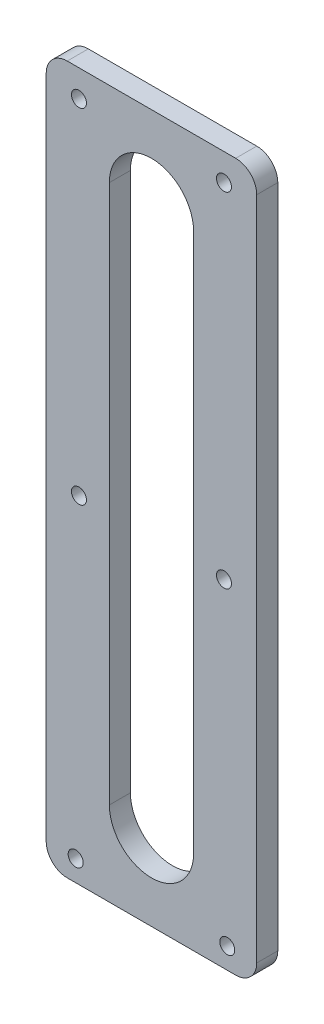
ISO-10303-21;
HEADER;
FILE_DESCRIPTION(('STEP AP214'),'2;1');
FILE_NAME('part.step','',(''),(''),'','','');
FILE_SCHEMA(('AUTOMOTIVE_DESIGN { 1 0 10303 214 1 1 1 1 }'));
ENDSEC;
DATA;
#1=APPLICATION_CONTEXT('core data for automotive mechanical design processes');
#2=APPLICATION_PROTOCOL_DEFINITION('international standard','automotive_design',2000,#1);
#3=PRODUCT_CONTEXT('',#1,'mechanical');
#4=PRODUCT('Part','Part','',(#3));
#5=PRODUCT_RELATED_PRODUCT_CATEGORY('part','',(#4));
#6=PRODUCT_DEFINITION_FORMATION('','',#4);
#7=PRODUCT_DEFINITION_CONTEXT('part definition',#1,'design');
#8=PRODUCT_DEFINITION('design','',#6,#7);
#9=PRODUCT_DEFINITION_SHAPE('','',#8);
#10=(LENGTH_UNIT() NAMED_UNIT(*) SI_UNIT(.MILLI.,.METRE.));
#11=(NAMED_UNIT(*) PLANE_ANGLE_UNIT() SI_UNIT($,.RADIAN.));
#12=(NAMED_UNIT(*) SI_UNIT($,.STERADIAN.) SOLID_ANGLE_UNIT());
#13=UNCERTAINTY_MEASURE_WITH_UNIT(LENGTH_MEASURE(1.E-05),#10,'distance_accuracy_value','');
#14=(GEOMETRIC_REPRESENTATION_CONTEXT(3) GLOBAL_UNCERTAINTY_ASSIGNED_CONTEXT((#13)) GLOBAL_UNIT_ASSIGNED_CONTEXT((#10,
#11,#12)) REPRESENTATION_CONTEXT('',''));
#15=CARTESIAN_POINT('',(0.,0.,0.));
#16=DIRECTION('',(0.,0.,1.));
#17=DIRECTION('',(1.,0.,0.));
#18=AXIS2_PLACEMENT_3D('',#15,#16,#17);
#19=CARTESIAN_POINT('',(0.,0.,0.));
#20=DIRECTION('',(0.,-1.,0.));
#21=DIRECTION('',(0.,0.,-1.));
#22=AXIS2_PLACEMENT_3D('',#19,#20,#21);
#23=PLANE('',#22);
#24=DIRECTION('',(1.,0.,0.));
#25=VECTOR('',#24,1.);
#26=CARTESIAN_POINT('',(0.,0.,0.));
#27=LINE('',#26,#25);
#28=CARTESIAN_POINT('',(3.175,0.,0.));
#29=VERTEX_POINT('',#28);
#30=CARTESIAN_POINT('',(28.575,0.,0.));
#31=VERTEX_POINT('',#30);
#32=EDGE_CURVE('E195',#29,#31,#27,.T.);
#33=ORIENTED_EDGE('',*,*,#32,.T.);
#34=DIRECTION('',(0.,0.,1.));
#35=VECTOR('',#34,1.);
#36=CARTESIAN_POINT('',(28.575,0.,0.));
#37=LINE('',#36,#35);
#38=CARTESIAN_POINT('',(28.575,0.,3.175));
#39=VERTEX_POINT('',#38);
#40=EDGE_CURVE('E228',#31,#39,#37,.T.);
#41=ORIENTED_EDGE('',*,*,#40,.T.);
#42=DIRECTION('',(1.,0.,0.));
#43=VECTOR('',#42,1.);
#44=CARTESIAN_POINT('',(0.,0.,3.175));
#45=LINE('',#44,#43);
#46=CARTESIAN_POINT('',(3.175,0.,3.175));
#47=VERTEX_POINT('',#46);
#48=EDGE_CURVE('E189',#47,#39,#45,.T.);
#49=ORIENTED_EDGE('',*,*,#48,.F.);
#50=DIRECTION('',(0.,0.,1.));
#51=VECTOR('',#50,1.);
#52=CARTESIAN_POINT('',(3.175,0.,0.));
#53=LINE('',#52,#51);
#54=EDGE_CURVE('E211',#47,#29,#53,.F.);
#55=ORIENTED_EDGE('',*,*,#54,.T.);
#56=EDGE_LOOP('',(#33,#41,#49,#55));
#57=FACE_BOUND('',#56,.T.);
#58=ADVANCED_FACE('F47',(#57),#23,.T.);
#59=CARTESIAN_POINT('',(0.,106.68,0.));
#60=DIRECTION('',(-1.,0.,0.));
#61=DIRECTION('',(0.,-1.,0.));
#62=AXIS2_PLACEMENT_3D('',#59,#60,#61);
#63=PLANE('',#62);
#64=DIRECTION('',(0.,-1.,0.));
#65=VECTOR('',#64,1.);
#66=CARTESIAN_POINT('',(0.,106.68,0.));
#67=LINE('',#66,#65);
#68=CARTESIAN_POINT('',(0.,103.505,0.));
#69=VERTEX_POINT('',#68);
#70=CARTESIAN_POINT('',(0.,3.17500000000003,0.));
#71=VERTEX_POINT('',#70);
#72=EDGE_CURVE('E207',#69,#71,#67,.T.);
#73=ORIENTED_EDGE('',*,*,#72,.T.);
#74=DIRECTION('',(0.,0.,1.));
#75=VECTOR('',#74,1.);
#76=CARTESIAN_POINT('',(0.,3.175,0.));
#77=LINE('',#76,#75);
#78=CARTESIAN_POINT('',(0.,3.17500000000003,3.175));
#79=VERTEX_POINT('',#78);
#80=EDGE_CURVE('E265',#71,#79,#77,.T.);
#81=ORIENTED_EDGE('',*,*,#80,.T.);
#82=DIRECTION('',(0.,-1.,0.));
#83=VECTOR('',#82,1.);
#84=CARTESIAN_POINT('',(0.,106.68,3.175));
#85=LINE('',#84,#83);
#86=CARTESIAN_POINT('',(0.,103.505,3.175));
#87=VERTEX_POINT('',#86);
#88=EDGE_CURVE('E200',#87,#79,#85,.T.);
#89=ORIENTED_EDGE('',*,*,#88,.F.);
#90=DIRECTION('',(0.,0.,1.));
#91=VECTOR('',#90,1.);
#92=CARTESIAN_POINT('',(0.,103.505,0.));
#93=LINE('',#92,#91);
#94=EDGE_CURVE('E262',#87,#69,#93,.F.);
#95=ORIENTED_EDGE('',*,*,#94,.T.);
#96=EDGE_LOOP('',(#73,#81,#89,#95));
#97=FACE_BOUND('',#96,.T.);
#98=ADVANCED_FACE('F298',(#97),#63,.T.);
#99=CARTESIAN_POINT('',(31.75,106.68,0.));
#100=DIRECTION('',(0.,1.,0.));
#101=DIRECTION('',(0.,0.,1.));
#102=AXIS2_PLACEMENT_3D('',#99,#100,#101);
#103=PLANE('',#102);
#104=DIRECTION('',(-1.,0.,0.));
#105=VECTOR('',#104,1.);
#106=CARTESIAN_POINT('',(31.75,106.68,3.175));
#107=LINE('',#106,#105);
#108=CARTESIAN_POINT('',(28.575,106.68,3.175));
#109=VERTEX_POINT('',#108);
#110=CARTESIAN_POINT('',(3.17499999999999,106.68,3.175));
#111=VERTEX_POINT('',#110);
#112=EDGE_CURVE('E219',#109,#111,#107,.T.);
#113=ORIENTED_EDGE('',*,*,#112,.F.);
#114=DIRECTION('',(0.,0.,1.));
#115=VECTOR('',#114,1.);
#116=CARTESIAN_POINT('',(28.575,106.68,0.));
#117=LINE('',#116,#115);
#118=CARTESIAN_POINT('',(28.575,106.68,0.));
#119=VERTEX_POINT('',#118);
#120=EDGE_CURVE('E11',#109,#119,#117,.F.);
#121=ORIENTED_EDGE('',*,*,#120,.T.);
#122=DIRECTION('',(-1.,0.,0.));
#123=VECTOR('',#122,1.);
#124=CARTESIAN_POINT('',(31.75,106.68,0.));
#125=LINE('',#124,#123);
#126=CARTESIAN_POINT('',(3.17499999999999,106.68,0.));
#127=VERTEX_POINT('',#126);
#128=EDGE_CURVE('E204',#119,#127,#125,.T.);
#129=ORIENTED_EDGE('',*,*,#128,.T.);
#130=DIRECTION('',(0.,0.,1.));
#131=VECTOR('',#130,1.);
#132=CARTESIAN_POINT('',(3.17499999999999,106.68,0.));
#133=LINE('',#132,#131);
#134=EDGE_CURVE('E56',#127,#111,#133,.T.);
#135=ORIENTED_EDGE('',*,*,#134,.T.);
#136=EDGE_LOOP('',(#113,#121,#129,#135));
#137=FACE_BOUND('',#136,.T.);
#138=ADVANCED_FACE('F271',(#137),#103,.T.);
#139=CARTESIAN_POINT('',(31.75,0.,0.));
#140=DIRECTION('',(1.,0.,0.));
#141=DIRECTION('',(0.,0.,-1.));
#142=AXIS2_PLACEMENT_3D('',#139,#140,#141);
#143=PLANE('',#142);
#144=DIRECTION('',(0.,1.,0.));
#145=VECTOR('',#144,1.);
#146=CARTESIAN_POINT('',(31.75,0.,3.175));
#147=LINE('',#146,#145);
#148=CARTESIAN_POINT('',(31.75,3.175,3.175));
#149=VERTEX_POINT('',#148);
#150=CARTESIAN_POINT('',(31.75,103.505,3.175));
#151=VERTEX_POINT('',#150);
#152=EDGE_CURVE('E215',#149,#151,#147,.T.);
#153=ORIENTED_EDGE('',*,*,#152,.F.);
#154=DIRECTION('',(0.,0.,1.));
#155=VECTOR('',#154,1.);
#156=CARTESIAN_POINT('',(31.75,3.175,0.));
#157=LINE('',#156,#155);
#158=CARTESIAN_POINT('',(31.75,3.175,0.));
#159=VERTEX_POINT('',#158);
#160=EDGE_CURVE('E248',#149,#159,#157,.F.);
#161=ORIENTED_EDGE('',*,*,#160,.T.);
#162=DIRECTION('',(0.,1.,0.));
#163=VECTOR('',#162,1.);
#164=CARTESIAN_POINT('',(31.75,0.,0.));
#165=LINE('',#164,#163);
#166=CARTESIAN_POINT('',(31.75,103.505,0.));
#167=VERTEX_POINT('',#166);
#168=EDGE_CURVE('E199',#159,#167,#165,.T.);
#169=ORIENTED_EDGE('',*,*,#168,.T.);
#170=DIRECTION('',(0.,0.,1.));
#171=VECTOR('',#170,1.);
#172=CARTESIAN_POINT('',(31.75,103.505,0.));
#173=LINE('',#172,#171);
#174=EDGE_CURVE('E244',#167,#151,#173,.T.);
#175=ORIENTED_EDGE('',*,*,#174,.T.);
#176=EDGE_LOOP('',(#153,#161,#169,#175));
#177=FACE_BOUND('',#176,.T.);
#178=ADVANCED_FACE('F282',(#177),#143,.T.);
#179=CARTESIAN_POINT('',(0.,0.,0.));
#180=DIRECTION('',(0.,0.,1.));
#181=DIRECTION('',(1.,0.,0.));
#182=AXIS2_PLACEMENT_3D('',#179,#180,#181);
#183=PLANE('',#182);
#184=CARTESIAN_POINT('',(4.44499999999999,3.175,0.));
#185=DIRECTION('',(0.,0.,-1.));
#186=DIRECTION('',(-1.,0.,0.));
#187=AXIS2_PLACEMENT_3D('',#184,#185,#186);
#188=CIRCLE('',#187,1.1303);
#189=CARTESIAN_POINT('',(3.31469999999999,3.175,0.));
#190=VERTEX_POINT('',#189);
#191=EDGE_CURVE('E561',#190,#190,#188,.T.);
#192=ORIENTED_EDGE('',*,*,#191,.F.);
#193=EDGE_LOOP('',(#192));
#194=FACE_BOUND('',#193,.T.);
#195=CARTESIAN_POINT('',(4.94030000000001,50.8,0.));
#196=DIRECTION('',(0.,0.,-1.));
#197=DIRECTION('',(-1.,0.,0.));
#198=AXIS2_PLACEMENT_3D('',#195,#196,#197);
#199=CIRCLE('',#198,1.1303);
#200=CARTESIAN_POINT('',(3.81000000000001,50.8,0.));
#201=VERTEX_POINT('',#200);
#202=EDGE_CURVE('E565',#201,#201,#199,.T.);
#203=ORIENTED_EDGE('',*,*,#202,.F.);
#204=EDGE_LOOP('',(#203));
#205=FACE_BOUND('',#204,.T.);
#206=CARTESIAN_POINT('',(27.305,3.175,0.));
#207=DIRECTION('',(0.,0.,-1.));
#208=DIRECTION('',(-1.,0.,0.));
#209=AXIS2_PLACEMENT_3D('',#206,#207,#208);
#210=CIRCLE('',#209,1.1303);
#211=CARTESIAN_POINT('',(26.1747,3.175,0.));
#212=VERTEX_POINT('',#211);
#213=EDGE_CURVE('E575',#212,#212,#210,.T.);
#214=ORIENTED_EDGE('',*,*,#213,.F.);
#215=EDGE_LOOP('',(#214));
#216=FACE_BOUND('',#215,.T.);
#217=CARTESIAN_POINT('',(26.8097,50.8,0.));
#218=DIRECTION('',(0.,0.,-1.));
#219=DIRECTION('',(-1.,0.,0.));
#220=AXIS2_PLACEMENT_3D('',#217,#218,#219);
#221=CIRCLE('',#220,1.1303);
#222=CARTESIAN_POINT('',(25.6794,50.8,0.));
#223=VERTEX_POINT('',#222);
#224=EDGE_CURVE('E583',#223,#223,#221,.T.);
#225=ORIENTED_EDGE('',*,*,#224,.F.);
#226=EDGE_LOOP('',(#225));
#227=FACE_BOUND('',#226,.T.);
#228=CARTESIAN_POINT('',(26.8097,102.616,0.));
#229=DIRECTION('',(0.,0.,-1.));
#230=DIRECTION('',(-1.,0.,0.));
#231=AXIS2_PLACEMENT_3D('',#228,#229,#230);
#232=CIRCLE('',#231,1.1303);
#233=CARTESIAN_POINT('',(25.6794,102.616,0.));
#234=VERTEX_POINT('',#233);
#235=EDGE_CURVE('E591',#234,#234,#232,.T.);
#236=ORIENTED_EDGE('',*,*,#235,.F.);
#237=EDGE_LOOP('',(#236));
#238=FACE_BOUND('',#237,.T.);
#239=CARTESIAN_POINT('',(4.94030000000001,102.616,0.));
#240=DIRECTION('',(0.,0.,-1.));
#241=DIRECTION('',(-1.,0.,0.));
#242=AXIS2_PLACEMENT_3D('',#239,#240,#241);
#243=CIRCLE('',#242,1.1303);
#244=CARTESIAN_POINT('',(3.81000000000001,102.616,0.));
#245=VERTEX_POINT('',#244);
#246=EDGE_CURVE('E598',#245,#245,#243,.T.);
#247=ORIENTED_EDGE('',*,*,#246,.F.);
#248=EDGE_LOOP('',(#247));
#249=FACE_BOUND('',#248,.T.);
#250=DIRECTION('',(0.,1.,0.));
#251=VECTOR('',#250,1.);
#252=CARTESIAN_POINT('',(22.225,93.98,0.));
#253=LINE('',#252,#251);
#254=CARTESIAN_POINT('',(22.225,12.7,0.));
#255=VERTEX_POINT('',#254);
#256=CARTESIAN_POINT('',(22.225,93.98,0.));
#257=VERTEX_POINT('',#256);
#258=EDGE_CURVE('E150',#255,#257,#253,.T.);
#259=ORIENTED_EDGE('',*,*,#258,.T.);
#260=CARTESIAN_POINT('',(15.875,93.98,0.));
#261=DIRECTION('',(0.,0.,1.));
#262=DIRECTION('',(-1.,0.,0.));
#263=AXIS2_PLACEMENT_3D('',#260,#261,#262);
#264=CIRCLE('',#263,6.34999999999999);
#265=CARTESIAN_POINT('',(9.52500000000002,93.98,0.));
#266=VERTEX_POINT('',#265);
#267=EDGE_CURVE('E141',#257,#266,#264,.T.);
#268=ORIENTED_EDGE('',*,*,#267,.T.);
#269=DIRECTION('',(0.,-1.,0.));
#270=VECTOR('',#269,1.);
#271=CARTESIAN_POINT('',(9.52500000000002,12.7,0.));
#272=LINE('',#271,#270);
#273=CARTESIAN_POINT('',(9.52500000000002,12.7,0.));
#274=VERTEX_POINT('',#273);
#275=EDGE_CURVE('E154',#266,#274,#272,.T.);
#276=ORIENTED_EDGE('',*,*,#275,.T.);
#277=CARTESIAN_POINT('',(15.875,12.7,0.));
#278=DIRECTION('',(0.,0.,1.));
#279=DIRECTION('',(-1.,0.,0.));
#280=AXIS2_PLACEMENT_3D('',#277,#278,#279);
#281=CIRCLE('',#280,6.35);
#282=EDGE_CURVE('E159',#274,#255,#281,.T.);
#283=ORIENTED_EDGE('',*,*,#282,.T.);
#284=EDGE_LOOP('',(#259,#268,#276,#283));
#285=FACE_BOUND('',#284,.T.);
#286=ORIENTED_EDGE('',*,*,#168,.F.);
#287=CARTESIAN_POINT('',(28.575,3.175,0.));
#288=DIRECTION('',(0.,0.,1.));
#289=DIRECTION('',(1.,0.,0.));
#290=AXIS2_PLACEMENT_3D('',#287,#288,#289);
#291=CIRCLE('',#290,3.175);
#292=EDGE_CURVE('E259',#159,#31,#291,.F.);
#293=ORIENTED_EDGE('',*,*,#292,.T.);
#294=ORIENTED_EDGE('',*,*,#32,.F.);
#295=CARTESIAN_POINT('',(3.175,3.175,0.));
#296=DIRECTION('',(0.,0.,1.));
#297=DIRECTION('',(1.,0.,0.));
#298=AXIS2_PLACEMENT_3D('',#295,#296,#297);
#299=CIRCLE('',#298,3.175);
#300=EDGE_CURVE('E256',#29,#71,#299,.F.);
#301=ORIENTED_EDGE('',*,*,#300,.T.);
#302=ORIENTED_EDGE('',*,*,#72,.F.);
#303=CARTESIAN_POINT('',(3.17499999999999,103.505,0.));
#304=DIRECTION('',(0.,0.,1.));
#305=DIRECTION('',(1.,0.,0.));
#306=AXIS2_PLACEMENT_3D('',#303,#304,#305);
#307=CIRCLE('',#306,3.175);
#308=EDGE_CURVE('E63',#69,#127,#307,.F.);
#309=ORIENTED_EDGE('',*,*,#308,.T.);
#310=ORIENTED_EDGE('',*,*,#128,.F.);
#311=CARTESIAN_POINT('',(28.575,103.505,0.));
#312=DIRECTION('',(0.,0.,1.));
#313=DIRECTION('',(1.,0.,0.));
#314=AXIS2_PLACEMENT_3D('',#311,#312,#313);
#315=CIRCLE('',#314,3.175);
#316=EDGE_CURVE('E253',#119,#167,#315,.F.);
#317=ORIENTED_EDGE('',*,*,#316,.T.);
#318=EDGE_LOOP('',(#286,#293,#294,#301,#302,#309,#310,#317));
#319=FACE_BOUND('',#318,.T.);
#320=ADVANCED_FACE('F161',(#194,#205,#216,#227,#238,#249,#285,#319),#183,.F.);
#321=CARTESIAN_POINT('',(0.,0.,3.175));
#322=DIRECTION('',(0.,0.,1.));
#323=DIRECTION('',(1.,0.,0.));
#324=AXIS2_PLACEMENT_3D('',#321,#322,#323);
#325=PLANE('',#324);
#326=CARTESIAN_POINT('',(4.44499999999999,3.175,3.175));
#327=DIRECTION('',(0.,0.,-1.));
#328=DIRECTION('',(-1.,0.,0.));
#329=AXIS2_PLACEMENT_3D('',#326,#327,#328);
#330=CIRCLE('',#329,1.1303);
#331=CARTESIAN_POINT('',(3.31469999999999,3.175,3.175));
#332=VERTEX_POINT('',#331);
#333=EDGE_CURVE('E558',#332,#332,#330,.T.);
#334=ORIENTED_EDGE('',*,*,#333,.T.);
#335=EDGE_LOOP('',(#334));
#336=FACE_BOUND('',#335,.T.);
#337=CARTESIAN_POINT('',(4.94030000000001,50.8,3.175));
#338=DIRECTION('',(0.,0.,-1.));
#339=DIRECTION('',(-1.,0.,0.));
#340=AXIS2_PLACEMENT_3D('',#337,#338,#339);
#341=CIRCLE('',#340,1.1303);
#342=CARTESIAN_POINT('',(3.81000000000001,50.8,3.175));
#343=VERTEX_POINT('',#342);
#344=EDGE_CURVE('E571',#343,#343,#341,.T.);
#345=ORIENTED_EDGE('',*,*,#344,.T.);
#346=EDGE_LOOP('',(#345));
#347=FACE_BOUND('',#346,.T.);
#348=CARTESIAN_POINT('',(27.305,3.175,3.175));
#349=DIRECTION('',(0.,0.,-1.));
#350=DIRECTION('',(-1.,0.,0.));
#351=AXIS2_PLACEMENT_3D('',#348,#349,#350);
#352=CIRCLE('',#351,1.1303);
#353=CARTESIAN_POINT('',(26.1747,3.175,3.175));
#354=VERTEX_POINT('',#353);
#355=EDGE_CURVE('E579',#354,#354,#352,.T.);
#356=ORIENTED_EDGE('',*,*,#355,.T.);
#357=EDGE_LOOP('',(#356));
#358=FACE_BOUND('',#357,.T.);
#359=CARTESIAN_POINT('',(26.8097,50.8,3.175));
#360=DIRECTION('',(0.,0.,-1.));
#361=DIRECTION('',(-1.,0.,0.));
#362=AXIS2_PLACEMENT_3D('',#359,#360,#361);
#363=CIRCLE('',#362,1.1303);
#364=CARTESIAN_POINT('',(25.6794,50.8,3.175));
#365=VERTEX_POINT('',#364);
#366=EDGE_CURVE('E587',#365,#365,#363,.T.);
#367=ORIENTED_EDGE('',*,*,#366,.T.);
#368=EDGE_LOOP('',(#367));
#369=FACE_BOUND('',#368,.T.);
#370=CARTESIAN_POINT('',(26.8097,102.616,3.175));
#371=DIRECTION('',(0.,0.,-1.));
#372=DIRECTION('',(-1.,0.,0.));
#373=AXIS2_PLACEMENT_3D('',#370,#371,#372);
#374=CIRCLE('',#373,1.1303);
#375=CARTESIAN_POINT('',(25.6794,102.616,3.175));
#376=VERTEX_POINT('',#375);
#377=EDGE_CURVE('E595',#376,#376,#374,.T.);
#378=ORIENTED_EDGE('',*,*,#377,.T.);
#379=EDGE_LOOP('',(#378));
#380=FACE_BOUND('',#379,.T.);
#381=CARTESIAN_POINT('',(4.94030000000001,102.616,3.175));
#382=DIRECTION('',(0.,0.,-1.));
#383=DIRECTION('',(-1.,0.,0.));
#384=AXIS2_PLACEMENT_3D('',#381,#382,#383);
#385=CIRCLE('',#384,1.1303);
#386=CARTESIAN_POINT('',(3.81000000000002,102.616,3.175));
#387=VERTEX_POINT('',#386);
#388=EDGE_CURVE('E171',#387,#387,#385,.T.);
#389=ORIENTED_EDGE('',*,*,#388,.T.);
#390=EDGE_LOOP('',(#389));
#391=FACE_BOUND('',#390,.T.);
#392=CARTESIAN_POINT('',(15.875,93.98,3.175));
#393=DIRECTION('',(0.,0.,1.));
#394=DIRECTION('',(-1.,0.,0.));
#395=AXIS2_PLACEMENT_3D('',#392,#393,#394);
#396=CIRCLE('',#395,6.34999999999999);
#397=CARTESIAN_POINT('',(22.225,93.98,3.175));
#398=VERTEX_POINT('',#397);
#399=CARTESIAN_POINT('',(9.52500000000002,93.98,3.175));
#400=VERTEX_POINT('',#399);
#401=EDGE_CURVE('E144',#398,#400,#396,.T.);
#402=ORIENTED_EDGE('',*,*,#401,.F.);
#403=DIRECTION('',(0.,1.,0.));
#404=VECTOR('',#403,1.);
#405=CARTESIAN_POINT('',(22.225,93.98,3.175));
#406=LINE('',#405,#404);
#407=CARTESIAN_POINT('',(22.225,12.7,3.175));
#408=VERTEX_POINT('',#407);
#409=EDGE_CURVE('E164',#408,#398,#406,.T.);
#410=ORIENTED_EDGE('',*,*,#409,.F.);
#411=CARTESIAN_POINT('',(15.875,12.7,3.175));
#412=DIRECTION('',(0.,0.,1.));
#413=DIRECTION('',(-1.,0.,0.));
#414=AXIS2_PLACEMENT_3D('',#411,#412,#413);
#415=CIRCLE('',#414,6.35);
#416=CARTESIAN_POINT('',(9.52500000000002,12.7,3.175));
#417=VERTEX_POINT('',#416);
#418=EDGE_CURVE('E168',#417,#408,#415,.T.);
#419=ORIENTED_EDGE('',*,*,#418,.F.);
#420=DIRECTION('',(0.,-1.,0.));
#421=VECTOR('',#420,1.);
#422=CARTESIAN_POINT('',(9.52500000000002,12.7,3.175));
#423=LINE('',#422,#421);
#424=EDGE_CURVE('E180',#400,#417,#423,.T.);
#425=ORIENTED_EDGE('',*,*,#424,.F.);
#426=EDGE_LOOP('',(#402,#410,#419,#425));
#427=FACE_BOUND('',#426,.T.);
#428=ORIENTED_EDGE('',*,*,#48,.T.);
#429=CARTESIAN_POINT('',(28.575,3.175,3.175));
#430=DIRECTION('',(0.,0.,1.));
#431=DIRECTION('',(1.,0.,0.));
#432=AXIS2_PLACEMENT_3D('',#429,#430,#431);
#433=CIRCLE('',#432,3.175);
#434=EDGE_CURVE('E241',#39,#149,#433,.T.);
#435=ORIENTED_EDGE('',*,*,#434,.T.);
#436=ORIENTED_EDGE('',*,*,#152,.T.);
#437=CARTESIAN_POINT('',(28.575,103.505,3.175));
#438=DIRECTION('',(0.,0.,1.));
#439=DIRECTION('',(1.,0.,0.));
#440=AXIS2_PLACEMENT_3D('',#437,#438,#439);
#441=CIRCLE('',#440,3.175);
#442=EDGE_CURVE('E235',#151,#109,#441,.T.);
#443=ORIENTED_EDGE('',*,*,#442,.T.);
#444=ORIENTED_EDGE('',*,*,#112,.T.);
#445=CARTESIAN_POINT('',(3.17499999999999,103.505,3.175));
#446=DIRECTION('',(0.,0.,1.));
#447=DIRECTION('',(1.,0.,0.));
#448=AXIS2_PLACEMENT_3D('',#445,#446,#447);
#449=CIRCLE('',#448,3.175);
#450=EDGE_CURVE('E232',#111,#87,#449,.T.);
#451=ORIENTED_EDGE('',*,*,#450,.T.);
#452=ORIENTED_EDGE('',*,*,#88,.T.);
#453=CARTESIAN_POINT('',(3.175,3.175,3.175));
#454=DIRECTION('',(0.,0.,1.));
#455=DIRECTION('',(1.,0.,0.));
#456=AXIS2_PLACEMENT_3D('',#453,#454,#455);
#457=CIRCLE('',#456,3.175);
#458=EDGE_CURVE('E238',#79,#47,#457,.T.);
#459=ORIENTED_EDGE('',*,*,#458,.T.);
#460=EDGE_LOOP('',(#428,#435,#436,#443,#444,#451,#452,#459));
#461=FACE_BOUND('',#460,.T.);
#462=ADVANCED_FACE('F274',(#336,#347,#358,#369,#380,#391,#427,#461),#325,.T.);
#463=CARTESIAN_POINT('',(15.875,93.98,0.));
#464=DIRECTION('',(0.,0.,1.));
#465=DIRECTION('',(1.,0.,0.));
#466=AXIS2_PLACEMENT_3D('',#463,#464,#465);
#467=CYLINDRICAL_SURFACE('',#466,6.34999999999999);
#468=ORIENTED_EDGE('',*,*,#401,.T.);
#469=DIRECTION('',(0.,0.,1.));
#470=VECTOR('',#469,1.);
#471=CARTESIAN_POINT('',(9.52500000000002,93.98,0.));
#472=LINE('',#471,#470);
#473=EDGE_CURVE('E137',#266,#400,#472,.T.);
#474=ORIENTED_EDGE('',*,*,#473,.F.);
#475=ORIENTED_EDGE('',*,*,#267,.F.);
#476=DIRECTION('',(0.,0.,1.));
#477=VECTOR('',#476,1.);
#478=CARTESIAN_POINT('',(22.225,93.98,0.));
#479=LINE('',#478,#477);
#480=EDGE_CURVE('E186',#257,#398,#479,.T.);
#481=ORIENTED_EDGE('',*,*,#480,.T.);
#482=EDGE_LOOP('',(#468,#474,#475,#481));
#483=FACE_BOUND('',#482,.T.);
#484=ADVANCED_FACE('F139',(#483),#467,.F.);
#485=CARTESIAN_POINT('',(22.225,93.98,0.));
#486=DIRECTION('',(1.,0.,0.));
#487=DIRECTION('',(0.,1.,0.));
#488=AXIS2_PLACEMENT_3D('',#485,#486,#487);
#489=PLANE('',#488);
#490=ORIENTED_EDGE('',*,*,#409,.T.);
#491=ORIENTED_EDGE('',*,*,#480,.F.);
#492=ORIENTED_EDGE('',*,*,#258,.F.);
#493=DIRECTION('',(0.,0.,1.));
#494=VECTOR('',#493,1.);
#495=CARTESIAN_POINT('',(22.225,12.7,0.));
#496=LINE('',#495,#494);
#497=EDGE_CURVE('E190',#255,#408,#496,.T.);
#498=ORIENTED_EDGE('',*,*,#497,.T.);
#499=EDGE_LOOP('',(#490,#491,#492,#498));
#500=FACE_BOUND('',#499,.T.);
#501=ADVANCED_FACE('F482',(#500),#489,.F.);
#502=CARTESIAN_POINT('',(15.875,12.7,0.));
#503=DIRECTION('',(0.,0.,1.));
#504=DIRECTION('',(1.,0.,0.));
#505=AXIS2_PLACEMENT_3D('',#502,#503,#504);
#506=CYLINDRICAL_SURFACE('',#505,6.35);
#507=ORIENTED_EDGE('',*,*,#418,.T.);
#508=ORIENTED_EDGE('',*,*,#497,.F.);
#509=ORIENTED_EDGE('',*,*,#282,.F.);
#510=DIRECTION('',(0.,0.,1.));
#511=VECTOR('',#510,1.);
#512=CARTESIAN_POINT('',(9.52500000000002,12.7,0.));
#513=LINE('',#512,#511);
#514=EDGE_CURVE('E149',#274,#417,#513,.T.);
#515=ORIENTED_EDGE('',*,*,#514,.T.);
#516=EDGE_LOOP('',(#507,#508,#509,#515));
#517=FACE_BOUND('',#516,.T.);
#518=ADVANCED_FACE('F471',(#517),#506,.F.);
#519=CARTESIAN_POINT('',(9.52500000000002,12.7,0.));
#520=DIRECTION('',(-1.,0.,0.));
#521=DIRECTION('',(0.,-1.,0.));
#522=AXIS2_PLACEMENT_3D('',#519,#520,#521);
#523=PLANE('',#522);
#524=ORIENTED_EDGE('',*,*,#424,.T.);
#525=ORIENTED_EDGE('',*,*,#514,.F.);
#526=ORIENTED_EDGE('',*,*,#275,.F.);
#527=ORIENTED_EDGE('',*,*,#473,.T.);
#528=EDGE_LOOP('',(#524,#525,#526,#527));
#529=FACE_BOUND('',#528,.T.);
#530=ADVANCED_FACE('F155',(#529),#523,.F.);
#531=CARTESIAN_POINT('',(28.575,3.175,0.));
#532=DIRECTION('',(0.,0.,1.));
#533=DIRECTION('',(1.,0.,0.));
#534=AXIS2_PLACEMENT_3D('',#531,#532,#533);
#535=CYLINDRICAL_SURFACE('',#534,3.175);
#536=ORIENTED_EDGE('',*,*,#292,.F.);
#537=ORIENTED_EDGE('',*,*,#160,.F.);
#538=ORIENTED_EDGE('',*,*,#434,.F.);
#539=ORIENTED_EDGE('',*,*,#40,.F.);
#540=EDGE_LOOP('',(#536,#537,#538,#539));
#541=FACE_BOUND('',#540,.T.);
#542=ADVANCED_FACE('F289',(#541),#535,.T.);
#543=CARTESIAN_POINT('',(3.175,3.175,0.));
#544=DIRECTION('',(0.,0.,1.));
#545=DIRECTION('',(1.,0.,0.));
#546=AXIS2_PLACEMENT_3D('',#543,#544,#545);
#547=CYLINDRICAL_SURFACE('',#546,3.175);
#548=ORIENTED_EDGE('',*,*,#300,.F.);
#549=ORIENTED_EDGE('',*,*,#54,.F.);
#550=ORIENTED_EDGE('',*,*,#458,.F.);
#551=ORIENTED_EDGE('',*,*,#80,.F.);
#552=EDGE_LOOP('',(#548,#549,#550,#551));
#553=FACE_BOUND('',#552,.T.);
#554=ADVANCED_FACE('F296',(#553),#547,.T.);
#555=CARTESIAN_POINT('',(28.575,103.505,0.));
#556=DIRECTION('',(0.,0.,1.));
#557=DIRECTION('',(1.,0.,0.));
#558=AXIS2_PLACEMENT_3D('',#555,#556,#557);
#559=CYLINDRICAL_SURFACE('',#558,3.175);
#560=ORIENTED_EDGE('',*,*,#316,.F.);
#561=ORIENTED_EDGE('',*,*,#120,.F.);
#562=ORIENTED_EDGE('',*,*,#442,.F.);
#563=ORIENTED_EDGE('',*,*,#174,.F.);
#564=EDGE_LOOP('',(#560,#561,#562,#563));
#565=FACE_BOUND('',#564,.T.);
#566=ADVANCED_FACE('F280',(#565),#559,.T.);
#567=CARTESIAN_POINT('',(3.17499999999999,103.505,0.));
#568=DIRECTION('',(0.,0.,1.));
#569=DIRECTION('',(1.,0.,0.));
#570=AXIS2_PLACEMENT_3D('',#567,#568,#569);
#571=CYLINDRICAL_SURFACE('',#570,3.175);
#572=ORIENTED_EDGE('',*,*,#308,.F.);
#573=ORIENTED_EDGE('',*,*,#94,.F.);
#574=ORIENTED_EDGE('',*,*,#450,.F.);
#575=ORIENTED_EDGE('',*,*,#134,.F.);
#576=EDGE_LOOP('',(#572,#573,#574,#575));
#577=FACE_BOUND('',#576,.T.);
#578=ADVANCED_FACE('F49',(#577),#571,.T.);
#579=CARTESIAN_POINT('',(4.94030000000001,102.616,0.));
#580=DIRECTION('',(0.,0.,-1.));
#581=DIRECTION('',(-1.,0.,0.));
#582=AXIS2_PLACEMENT_3D('',#579,#580,#581);
#583=CYLINDRICAL_SURFACE('',#582,1.1303);
#584=ORIENTED_EDGE('',*,*,#388,.F.);
#585=EDGE_LOOP('',(#584));
#586=FACE_BOUND('',#585,.T.);
#587=ORIENTED_EDGE('',*,*,#246,.T.);
#588=EDGE_LOOP('',(#587));
#589=FACE_BOUND('',#588,.T.);
#590=ADVANCED_FACE('F301',(#586,#589),#583,.F.);
#591=CARTESIAN_POINT('',(26.8097,102.616,0.));
#592=DIRECTION('',(0.,0.,-1.));
#593=DIRECTION('',(-1.,0.,0.));
#594=AXIS2_PLACEMENT_3D('',#591,#592,#593);
#595=CYLINDRICAL_SURFACE('',#594,1.1303);
#596=ORIENTED_EDGE('',*,*,#377,.F.);
#597=EDGE_LOOP('',(#596));
#598=FACE_BOUND('',#597,.T.);
#599=ORIENTED_EDGE('',*,*,#235,.T.);
#600=EDGE_LOOP('',(#599));
#601=FACE_BOUND('',#600,.T.);
#602=ADVANCED_FACE('F306',(#598,#601),#595,.F.);
#603=CARTESIAN_POINT('',(26.8097,50.8,0.));
#604=DIRECTION('',(0.,0.,-1.));
#605=DIRECTION('',(-1.,0.,0.));
#606=AXIS2_PLACEMENT_3D('',#603,#604,#605);
#607=CYLINDRICAL_SURFACE('',#606,1.1303);
#608=ORIENTED_EDGE('',*,*,#366,.F.);
#609=EDGE_LOOP('',(#608));
#610=FACE_BOUND('',#609,.T.);
#611=ORIENTED_EDGE('',*,*,#224,.T.);
#612=EDGE_LOOP('',(#611));
#613=FACE_BOUND('',#612,.T.);
#614=ADVANCED_FACE('F381',(#610,#613),#607,.F.);
#615=CARTESIAN_POINT('',(27.305,3.175,0.));
#616=DIRECTION('',(0.,0.,-1.));
#617=DIRECTION('',(-1.,0.,0.));
#618=AXIS2_PLACEMENT_3D('',#615,#616,#617);
#619=CYLINDRICAL_SURFACE('',#618,1.1303);
#620=ORIENTED_EDGE('',*,*,#355,.F.);
#621=EDGE_LOOP('',(#620));
#622=FACE_BOUND('',#621,.T.);
#623=ORIENTED_EDGE('',*,*,#213,.T.);
#624=EDGE_LOOP('',(#623));
#625=FACE_BOUND('',#624,.T.);
#626=ADVANCED_FACE('F393',(#622,#625),#619,.F.);
#627=CARTESIAN_POINT('',(4.94030000000001,50.8,0.));
#628=DIRECTION('',(0.,0.,-1.));
#629=DIRECTION('',(-1.,0.,0.));
#630=AXIS2_PLACEMENT_3D('',#627,#628,#629);
#631=CYLINDRICAL_SURFACE('',#630,1.1303);
#632=ORIENTED_EDGE('',*,*,#344,.F.);
#633=EDGE_LOOP('',(#632));
#634=FACE_BOUND('',#633,.T.);
#635=ORIENTED_EDGE('',*,*,#202,.T.);
#636=EDGE_LOOP('',(#635));
#637=FACE_BOUND('',#636,.T.);
#638=ADVANCED_FACE('F406',(#634,#637),#631,.F.);
#639=CARTESIAN_POINT('',(4.44499999999999,3.175,0.));
#640=DIRECTION('',(0.,0.,-1.));
#641=DIRECTION('',(-1.,0.,0.));
#642=AXIS2_PLACEMENT_3D('',#639,#640,#641);
#643=CYLINDRICAL_SURFACE('',#642,1.1303);
#644=ORIENTED_EDGE('',*,*,#333,.F.);
#645=EDGE_LOOP('',(#644));
#646=FACE_BOUND('',#645,.T.);
#647=ORIENTED_EDGE('',*,*,#191,.T.);
#648=EDGE_LOOP('',(#647));
#649=FACE_BOUND('',#648,.T.);
#650=ADVANCED_FACE('F419',(#646,#649),#643,.F.);
#651=CLOSED_SHELL('',(#58,#98,#138,#178,#320,#462,#484,#501,#518,#530,#542,#554,#566,#578,#590,
#602,#614,#626,#638,#650));
#652=MANIFOLD_SOLID_BREP('B2',#651);
#653=ADVANCED_BREP_SHAPE_REPRESENTATION('',(#18,#652),#14);
#654=SHAPE_DEFINITION_REPRESENTATION(#9,#653);
ENDSEC;
END-ISO-10303-21;
